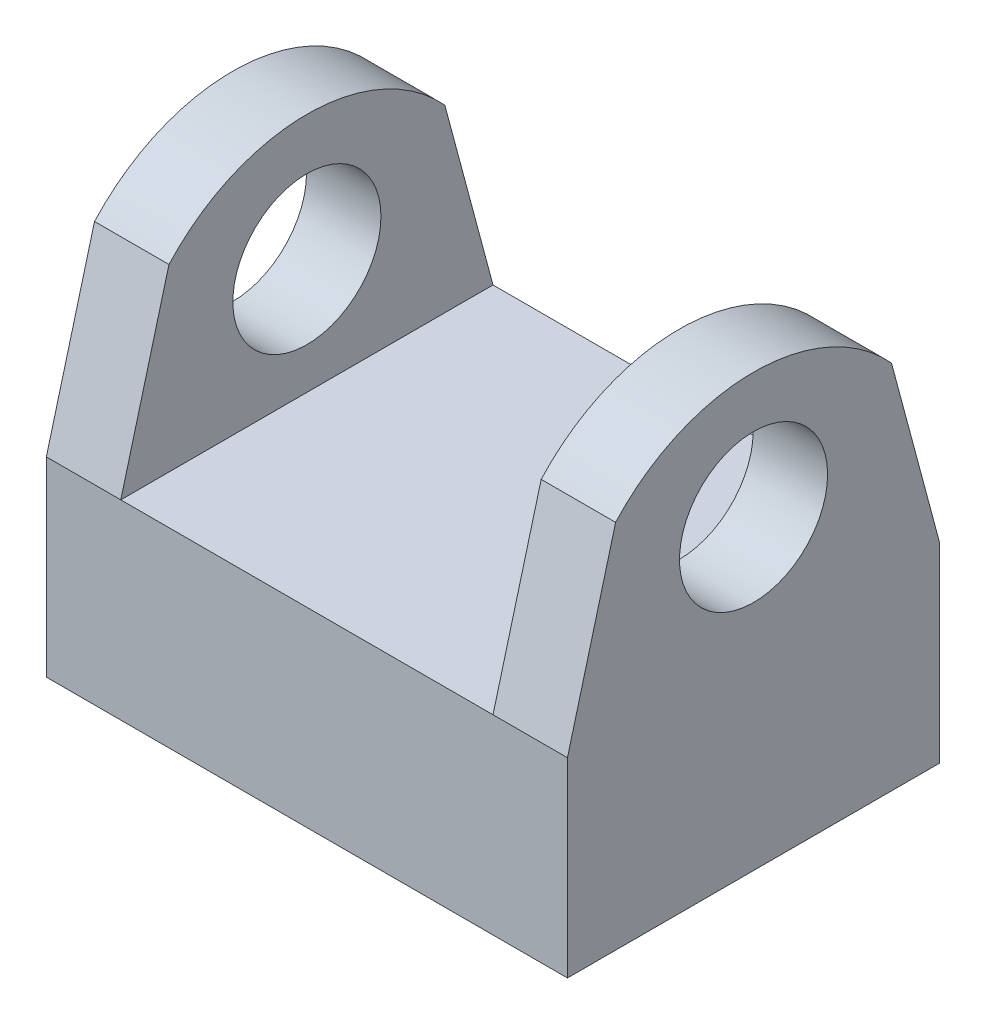
ISO-10303-21;
HEADER;
FILE_DESCRIPTION(('STEP AP214'),'2;1');
FILE_NAME('part.step','',(''),(''),'','','');
FILE_SCHEMA(('AUTOMOTIVE_DESIGN { 1 0 10303 214 1 1 1 1 }'));
ENDSEC;
DATA;
#1=APPLICATION_CONTEXT('core data for automotive mechanical design processes');
#2=APPLICATION_PROTOCOL_DEFINITION('international standard','automotive_design',2000,#1);
#3=PRODUCT_CONTEXT('',#1,'mechanical');
#4=PRODUCT('Part','Part','',(#3));
#5=PRODUCT_RELATED_PRODUCT_CATEGORY('part','',(#4));
#6=PRODUCT_DEFINITION_FORMATION('','',#4);
#7=PRODUCT_DEFINITION_CONTEXT('part definition',#1,'design');
#8=PRODUCT_DEFINITION('design','',#6,#7);
#9=PRODUCT_DEFINITION_SHAPE('','',#8);
#10=(LENGTH_UNIT() NAMED_UNIT(*) SI_UNIT(.MILLI.,.METRE.));
#11=(NAMED_UNIT(*) PLANE_ANGLE_UNIT() SI_UNIT($,.RADIAN.));
#12=(NAMED_UNIT(*) SI_UNIT($,.STERADIAN.) SOLID_ANGLE_UNIT());
#13=UNCERTAINTY_MEASURE_WITH_UNIT(LENGTH_MEASURE(1.E-05),#10,'distance_accuracy_value','');
#14=(GEOMETRIC_REPRESENTATION_CONTEXT(3) GLOBAL_UNCERTAINTY_ASSIGNED_CONTEXT((#13)) GLOBAL_UNIT_ASSIGNED_CONTEXT((#10,
#11,#12)) REPRESENTATION_CONTEXT('',''));
#15=CARTESIAN_POINT('',(0.,0.,0.));
#16=DIRECTION('',(0.,0.,1.));
#17=DIRECTION('',(1.,0.,0.));
#18=AXIS2_PLACEMENT_3D('',#15,#16,#17);
#19=CARTESIAN_POINT('',(-17.78,13.0175,12.7));
#20=DIRECTION('',(-1.,0.,0.));
#21=DIRECTION('',(0.,0.,1.));
#22=AXIS2_PLACEMENT_3D('',#19,#20,#21);
#23=PLANE('',#22);
#24=CARTESIAN_POINT('',(-17.78,20.8915,0.));
#25=DIRECTION('',(1.,0.,0.));
#26=DIRECTION('',(0.,0.,-1.));
#27=AXIS2_PLACEMENT_3D('',#24,#25,#26);
#28=CIRCLE('',#27,5.05316944316768);
#29=CARTESIAN_POINT('',(-17.78,20.8915,-5.05316944316768));
#30=VERTEX_POINT('',#29);
#31=EDGE_CURVE('E192',#30,#30,#28,.T.);
#32=ORIENTED_EDGE('',*,*,#31,.T.);
#33=EDGE_LOOP('',(#32));
#34=FACE_BOUND('',#33,.T.);
#35=DIRECTION('',(0.,0.,-1.));
#36=VECTOR('',#35,1.);
#37=CARTESIAN_POINT('',(-17.78,0.,12.7));
#38=LINE('',#37,#36);
#39=CARTESIAN_POINT('',(-17.78,0.,12.7));
#40=VERTEX_POINT('',#39);
#41=CARTESIAN_POINT('',(-17.78,0.,-12.7));
#42=VERTEX_POINT('',#41);
#43=EDGE_CURVE('E104',#40,#42,#38,.T.);
#44=ORIENTED_EDGE('',*,*,#43,.F.);
#45=DIRECTION('',(0.,-1.,0.));
#46=VECTOR('',#45,1.);
#47=CARTESIAN_POINT('',(-17.78,13.0175,12.7));
#48=LINE('',#47,#46);
#49=CARTESIAN_POINT('',(-17.78,13.0175,12.7));
#50=VERTEX_POINT('',#49);
#51=EDGE_CURVE('E11',#50,#40,#48,.T.);
#52=ORIENTED_EDGE('',*,*,#51,.F.);
#53=DIRECTION('',(0.,-0.965925826289069,0.258819045102518));
#54=VECTOR('',#53,1.);
#55=CARTESIAN_POINT('',(-17.78,13.0175,12.7));
#56=LINE('',#55,#54);
#57=CARTESIAN_POINT('',(-17.78,25.2847579938712,9.41299812719803));
#58=VERTEX_POINT('',#57);
#59=EDGE_CURVE('E174',#58,#50,#56,.T.);
#60=ORIENTED_EDGE('',*,*,#59,.F.);
#61=CARTESIAN_POINT('',(-17.78,16.7436568597658,0.));
#62=DIRECTION('',(1.,0.,0.));
#63=DIRECTION('',(0.,0.,1.));
#64=AXIS2_PLACEMENT_3D('',#61,#62,#63);
#65=CIRCLE('',#64,12.7104265202097);
#66=CARTESIAN_POINT('',(-17.78,25.2847579938712,-9.41299812719793));
#67=VERTEX_POINT('',#66);
#68=EDGE_CURVE('E171',#67,#58,#65,.T.);
#69=ORIENTED_EDGE('',*,*,#68,.F.);
#70=DIRECTION('',(0.,0.965925826289067,0.258819045102525));
#71=VECTOR('',#70,1.);
#72=CARTESIAN_POINT('',(-17.78,13.0175,-12.7));
#73=LINE('',#72,#71);
#74=CARTESIAN_POINT('',(-17.78,13.0175,-12.7));
#75=VERTEX_POINT('',#74);
#76=EDGE_CURVE('E168',#75,#67,#73,.T.);
#77=ORIENTED_EDGE('',*,*,#76,.F.);
#78=DIRECTION('',(0.,-1.,0.));
#79=VECTOR('',#78,1.);
#80=CARTESIAN_POINT('',(-17.78,13.0175,-12.7));
#81=LINE('',#80,#79);
#82=EDGE_CURVE('E108',#75,#42,#81,.T.);
#83=ORIENTED_EDGE('',*,*,#82,.T.);
#84=EDGE_LOOP('',(#44,#52,#60,#69,#77,#83));
#85=FACE_BOUND('',#84,.T.);
#86=ADVANCED_FACE('F35',(#34,#85),#23,.T.);
#87=CARTESIAN_POINT('',(-17.78,13.0175,12.7));
#88=DIRECTION('',(0.,0.,-1.));
#89=DIRECTION('',(-1.,0.,0.));
#90=AXIS2_PLACEMENT_3D('',#87,#88,#89);
#91=PLANE('',#90);
#92=DIRECTION('',(1.,0.,0.));
#93=VECTOR('',#92,1.);
#94=CARTESIAN_POINT('',(-17.78,0.,12.7));
#95=LINE('',#94,#93);
#96=CARTESIAN_POINT('',(17.78,0.,12.7));
#97=VERTEX_POINT('',#96);
#98=EDGE_CURVE('E77',#40,#97,#95,.T.);
#99=ORIENTED_EDGE('',*,*,#98,.T.);
#100=DIRECTION('',(0.,-1.,0.));
#101=VECTOR('',#100,1.);
#102=CARTESIAN_POINT('',(17.78,13.0175,12.7));
#103=LINE('',#102,#101);
#104=CARTESIAN_POINT('',(17.78,13.0175,12.7));
#105=VERTEX_POINT('',#104);
#106=EDGE_CURVE('E43',#105,#97,#103,.T.);
#107=ORIENTED_EDGE('',*,*,#106,.F.);
#108=DIRECTION('',(1.,0.,0.));
#109=VECTOR('',#108,1.);
#110=CARTESIAN_POINT('',(12.7,13.0175,12.7));
#111=LINE('',#110,#109);
#112=CARTESIAN_POINT('',(12.7,13.0175,12.7));
#113=VERTEX_POINT('',#112);
#114=EDGE_CURVE('E123',#113,#105,#111,.T.);
#115=ORIENTED_EDGE('',*,*,#114,.F.);
#116=DIRECTION('',(1.,0.,0.));
#117=VECTOR('',#116,1.);
#118=CARTESIAN_POINT('',(-17.78,13.0175,12.7));
#119=LINE('',#118,#117);
#120=CARTESIAN_POINT('',(-12.7,13.0175,12.7));
#121=VERTEX_POINT('',#120);
#122=EDGE_CURVE('E113',#121,#113,#119,.T.);
#123=ORIENTED_EDGE('',*,*,#122,.F.);
#124=EDGE_CURVE('E109',#50,#121,#119,.T.);
#125=ORIENTED_EDGE('',*,*,#124,.F.);
#126=ORIENTED_EDGE('',*,*,#51,.T.);
#127=EDGE_LOOP('',(#99,#107,#115,#123,#125,#126));
#128=FACE_BOUND('',#127,.T.);
#129=ADVANCED_FACE('F79',(#128),#91,.F.);
#130=CARTESIAN_POINT('',(17.78,13.0175,12.7));
#131=DIRECTION('',(-1.,0.,0.));
#132=DIRECTION('',(0.,0.,1.));
#133=AXIS2_PLACEMENT_3D('',#130,#131,#132);
#134=PLANE('',#133);
#135=CARTESIAN_POINT('',(17.78,20.8915,0.));
#136=DIRECTION('',(1.,0.,0.));
#137=DIRECTION('',(0.,0.,-1.));
#138=AXIS2_PLACEMENT_3D('',#135,#136,#137);
#139=CIRCLE('',#138,5.05316944316768);
#140=CARTESIAN_POINT('',(17.78,20.8915,-5.05316944316768));
#141=VERTEX_POINT('',#140);
#142=EDGE_CURVE('E189',#141,#141,#139,.T.);
#143=ORIENTED_EDGE('',*,*,#142,.F.);
#144=EDGE_LOOP('',(#143));
#145=FACE_BOUND('',#144,.T.);
#146=DIRECTION('',(0.,0.,-1.));
#147=VECTOR('',#146,1.);
#148=CARTESIAN_POINT('',(17.78,0.,12.7));
#149=LINE('',#148,#147);
#150=CARTESIAN_POINT('',(17.78,0.,-12.7));
#151=VERTEX_POINT('',#150);
#152=EDGE_CURVE('E87',#97,#151,#149,.T.);
#153=ORIENTED_EDGE('',*,*,#152,.T.);
#154=DIRECTION('',(0.,-1.,0.));
#155=VECTOR('',#154,1.);
#156=CARTESIAN_POINT('',(17.78,13.0175,-12.7));
#157=LINE('',#156,#155);
#158=CARTESIAN_POINT('',(17.78,13.0175,-12.7));
#159=VERTEX_POINT('',#158);
#160=EDGE_CURVE('E98',#159,#151,#157,.T.);
#161=ORIENTED_EDGE('',*,*,#160,.F.);
#162=DIRECTION('',(0.,0.965925826289067,0.258819045102525));
#163=VECTOR('',#162,1.);
#164=CARTESIAN_POINT('',(17.78,13.0175,-12.7));
#165=LINE('',#164,#163);
#166=CARTESIAN_POINT('',(17.78,25.2847579938712,-9.41299812719793));
#167=VERTEX_POINT('',#166);
#168=EDGE_CURVE('E149',#159,#167,#165,.T.);
#169=ORIENTED_EDGE('',*,*,#168,.T.);
#170=CARTESIAN_POINT('',(17.78,16.7436568597658,0.));
#171=DIRECTION('',(1.,0.,0.));
#172=DIRECTION('',(0.,0.,1.));
#173=AXIS2_PLACEMENT_3D('',#170,#171,#172);
#174=CIRCLE('',#173,12.7104265202097);
#175=CARTESIAN_POINT('',(17.78,25.2847579938712,9.41299812719803));
#176=VERTEX_POINT('',#175);
#177=EDGE_CURVE('E151',#167,#176,#174,.T.);
#178=ORIENTED_EDGE('',*,*,#177,.T.);
#179=DIRECTION('',(0.,-0.965925826289069,0.258819045102518));
#180=VECTOR('',#179,1.);
#181=CARTESIAN_POINT('',(17.78,13.0175,12.7));
#182=LINE('',#181,#180);
#183=EDGE_CURVE('E97',#176,#105,#182,.T.);
#184=ORIENTED_EDGE('',*,*,#183,.T.);
#185=ORIENTED_EDGE('',*,*,#106,.T.);
#186=EDGE_LOOP('',(#153,#161,#169,#178,#184,#185));
#187=FACE_BOUND('',#186,.T.);
#188=ADVANCED_FACE('F92',(#145,#187),#134,.F.);
#189=CARTESIAN_POINT('',(-17.78,13.0175,-12.7));
#190=DIRECTION('',(0.,0.,-1.));
#191=DIRECTION('',(-1.,0.,0.));
#192=AXIS2_PLACEMENT_3D('',#189,#190,#191);
#193=PLANE('',#192);
#194=DIRECTION('',(1.,0.,0.));
#195=VECTOR('',#194,1.);
#196=CARTESIAN_POINT('',(-17.78,0.,-12.7));
#197=LINE('',#196,#195);
#198=EDGE_CURVE('E102',#42,#151,#197,.T.);
#199=ORIENTED_EDGE('',*,*,#198,.F.);
#200=ORIENTED_EDGE('',*,*,#82,.F.);
#201=DIRECTION('',(1.,0.,0.));
#202=VECTOR('',#201,1.);
#203=CARTESIAN_POINT('',(-17.78,13.0175,-12.7));
#204=LINE('',#203,#202);
#205=CARTESIAN_POINT('',(-12.7,13.0175,-12.7));
#206=VERTEX_POINT('',#205);
#207=EDGE_CURVE('E59',#75,#206,#204,.T.);
#208=ORIENTED_EDGE('',*,*,#207,.T.);
#209=CARTESIAN_POINT('',(12.7,13.0175,-12.7));
#210=VERTEX_POINT('',#209);
#211=EDGE_CURVE('E51',#206,#210,#204,.T.);
#212=ORIENTED_EDGE('',*,*,#211,.T.);
#213=DIRECTION('',(1.,0.,0.));
#214=VECTOR('',#213,1.);
#215=CARTESIAN_POINT('',(12.7,13.0175,-12.7));
#216=LINE('',#215,#214);
#217=EDGE_CURVE('E136',#210,#159,#216,.T.);
#218=ORIENTED_EDGE('',*,*,#217,.T.);
#219=ORIENTED_EDGE('',*,*,#160,.T.);
#220=EDGE_LOOP('',(#199,#200,#208,#212,#218,#219));
#221=FACE_BOUND('',#220,.T.);
#222=ADVANCED_FACE('F213',(#221),#193,.T.);
#223=CARTESIAN_POINT('',(0.,13.0175,0.));
#224=DIRECTION('',(0.,-1.,0.));
#225=DIRECTION('',(0.,0.,-1.));
#226=AXIS2_PLACEMENT_3D('',#223,#224,#225);
#227=PLANE('',#226);
#228=ORIENTED_EDGE('',*,*,#211,.F.);
#229=DIRECTION('',(0.,0.,-1.));
#230=VECTOR('',#229,1.);
#231=CARTESIAN_POINT('',(-12.7,13.0175,12.7));
#232=LINE('',#231,#230);
#233=EDGE_CURVE('E170',#121,#206,#232,.T.);
#234=ORIENTED_EDGE('',*,*,#233,.F.);
#235=ORIENTED_EDGE('',*,*,#122,.T.);
#236=DIRECTION('',(0.,0.,-1.));
#237=VECTOR('',#236,1.);
#238=CARTESIAN_POINT('',(12.7,13.0175,12.7));
#239=LINE('',#238,#237);
#240=EDGE_CURVE('E155',#113,#210,#239,.T.);
#241=ORIENTED_EDGE('',*,*,#240,.T.);
#242=EDGE_LOOP('',(#228,#234,#235,#241));
#243=FACE_BOUND('',#242,.T.);
#244=ADVANCED_FACE('F212',(#243),#227,.F.);
#245=CARTESIAN_POINT('',(0.,0.,0.));
#246=DIRECTION('',(0.,-1.,0.));
#247=DIRECTION('',(0.,0.,-1.));
#248=AXIS2_PLACEMENT_3D('',#245,#246,#247);
#249=PLANE('',#248);
#250=ORIENTED_EDGE('',*,*,#43,.T.);
#251=ORIENTED_EDGE('',*,*,#198,.T.);
#252=ORIENTED_EDGE('',*,*,#152,.F.);
#253=ORIENTED_EDGE('',*,*,#98,.F.);
#254=EDGE_LOOP('',(#250,#251,#252,#253));
#255=FACE_BOUND('',#254,.T.);
#256=ADVANCED_FACE('F100',(#255),#249,.T.);
#257=CARTESIAN_POINT('',(12.7,13.0175,12.7));
#258=DIRECTION('',(0.,0.258819045102518,0.965925826289069));
#259=DIRECTION('',(0.,-0.965925826289069,0.258819045102518));
#260=AXIS2_PLACEMENT_3D('',#257,#258,#259);
#261=PLANE('',#260);
#262=ORIENTED_EDGE('',*,*,#183,.F.);
#263=DIRECTION('',(1.,0.,0.));
#264=VECTOR('',#263,1.);
#265=CARTESIAN_POINT('',(12.7,25.2847579938712,9.41299812719803));
#266=LINE('',#265,#264);
#267=CARTESIAN_POINT('',(12.7,25.2847579938712,9.41299812719803));
#268=VERTEX_POINT('',#267);
#269=EDGE_CURVE('E125',#268,#176,#266,.T.);
#270=ORIENTED_EDGE('',*,*,#269,.F.);
#271=DIRECTION('',(0.,-0.965925826289069,0.258819045102518));
#272=VECTOR('',#271,1.);
#273=CARTESIAN_POINT('',(12.7,13.0175,12.7));
#274=LINE('',#273,#272);
#275=EDGE_CURVE('E137',#268,#113,#274,.T.);
#276=ORIENTED_EDGE('',*,*,#275,.T.);
#277=ORIENTED_EDGE('',*,*,#114,.T.);
#278=EDGE_LOOP('',(#262,#270,#276,#277));
#279=FACE_BOUND('',#278,.T.);
#280=ADVANCED_FACE('F267',(#279),#261,.T.);
#281=CARTESIAN_POINT('',(12.7,16.7436568597658,0.));
#282=DIRECTION('',(1.,0.,0.));
#283=DIRECTION('',(0.,0.,-1.));
#284=AXIS2_PLACEMENT_3D('',#281,#282,#283);
#285=CYLINDRICAL_SURFACE('',#284,12.7104265202097);
#286=ORIENTED_EDGE('',*,*,#177,.F.);
#287=DIRECTION('',(1.,0.,0.));
#288=VECTOR('',#287,1.);
#289=CARTESIAN_POINT('',(12.7,25.2847579938712,-9.41299812719793));
#290=LINE('',#289,#288);
#291=CARTESIAN_POINT('',(12.7,25.2847579938712,-9.41299812719793));
#292=VERTEX_POINT('',#291);
#293=EDGE_CURVE('E130',#292,#167,#290,.T.);
#294=ORIENTED_EDGE('',*,*,#293,.F.);
#295=CARTESIAN_POINT('',(12.7,16.7436568597658,0.));
#296=DIRECTION('',(1.,0.,0.));
#297=DIRECTION('',(0.,0.,1.));
#298=AXIS2_PLACEMENT_3D('',#295,#296,#297);
#299=CIRCLE('',#298,12.7104265202097);
#300=EDGE_CURVE('E140',#292,#268,#299,.T.);
#301=ORIENTED_EDGE('',*,*,#300,.T.);
#302=ORIENTED_EDGE('',*,*,#269,.T.);
#303=EDGE_LOOP('',(#286,#294,#301,#302));
#304=FACE_BOUND('',#303,.T.);
#305=ADVANCED_FACE('F260',(#304),#285,.T.);
#306=CARTESIAN_POINT('',(12.7,13.0175,-12.7));
#307=DIRECTION('',(0.,0.258819045102525,-0.965925826289067));
#308=DIRECTION('',(0.,0.965925826289067,0.258819045102525));
#309=AXIS2_PLACEMENT_3D('',#306,#307,#308);
#310=PLANE('',#309);
#311=ORIENTED_EDGE('',*,*,#168,.F.);
#312=ORIENTED_EDGE('',*,*,#217,.F.);
#313=DIRECTION('',(0.,0.965925826289067,0.258819045102525));
#314=VECTOR('',#313,1.);
#315=CARTESIAN_POINT('',(12.7,13.0175,-12.7));
#316=LINE('',#315,#314);
#317=EDGE_CURVE('E145',#210,#292,#316,.T.);
#318=ORIENTED_EDGE('',*,*,#317,.T.);
#319=ORIENTED_EDGE('',*,*,#293,.T.);
#320=EDGE_LOOP('',(#311,#312,#318,#319));
#321=FACE_BOUND('',#320,.T.);
#322=ADVANCED_FACE('F258',(#321),#310,.T.);
#323=CARTESIAN_POINT('',(12.7,16.7436568597658,0.));
#324=DIRECTION('',(-1.,0.,0.));
#325=DIRECTION('',(0.,0.,1.));
#326=AXIS2_PLACEMENT_3D('',#323,#324,#325);
#327=PLANE('',#326);
#328=CARTESIAN_POINT('',(12.7,20.8915,0.));
#329=DIRECTION('',(-1.,0.,0.));
#330=DIRECTION('',(0.,0.,1.));
#331=AXIS2_PLACEMENT_3D('',#328,#329,#330);
#332=CIRCLE('',#331,5.05316944316768);
#333=CARTESIAN_POINT('',(12.7,20.8915,5.05316944316768));
#334=VERTEX_POINT('',#333);
#335=EDGE_CURVE('E176',#334,#334,#332,.T.);
#336=ORIENTED_EDGE('',*,*,#335,.F.);
#337=EDGE_LOOP('',(#336));
#338=FACE_BOUND('',#337,.T.);
#339=ORIENTED_EDGE('',*,*,#240,.F.);
#340=ORIENTED_EDGE('',*,*,#275,.F.);
#341=ORIENTED_EDGE('',*,*,#300,.F.);
#342=ORIENTED_EDGE('',*,*,#317,.F.);
#343=EDGE_LOOP('',(#339,#340,#341,#342));
#344=FACE_BOUND('',#343,.T.);
#345=ADVANCED_FACE('F257',(#338,#344),#327,.T.);
#346=CARTESIAN_POINT('',(-12.7,13.0175,-12.7));
#347=DIRECTION('',(0.,-0.258819045102525,0.965925826289067));
#348=DIRECTION('',(0.,-0.965925826289067,-0.258819045102525));
#349=AXIS2_PLACEMENT_3D('',#346,#347,#348);
#350=PLANE('',#349);
#351=ORIENTED_EDGE('',*,*,#76,.T.);
#352=DIRECTION('',(-1.,0.,0.));
#353=VECTOR('',#352,1.);
#354=CARTESIAN_POINT('',(-12.7,25.2847579938712,-9.41299812719793));
#355=LINE('',#354,#353);
#356=CARTESIAN_POINT('',(-12.7,25.2847579938712,-9.41299812719793));
#357=VERTEX_POINT('',#356);
#358=EDGE_CURVE('E152',#357,#67,#355,.T.);
#359=ORIENTED_EDGE('',*,*,#358,.F.);
#360=DIRECTION('',(0.,0.965925826289067,0.258819045102525));
#361=VECTOR('',#360,1.);
#362=CARTESIAN_POINT('',(-12.7,13.0175,-12.7));
#363=LINE('',#362,#361);
#364=EDGE_CURVE('E165',#206,#357,#363,.T.);
#365=ORIENTED_EDGE('',*,*,#364,.F.);
#366=ORIENTED_EDGE('',*,*,#207,.F.);
#367=EDGE_LOOP('',(#351,#359,#365,#366));
#368=FACE_BOUND('',#367,.T.);
#369=ADVANCED_FACE('F248',(#368),#350,.F.);
#370=CARTESIAN_POINT('',(-12.7,16.7436568597658,0.));
#371=DIRECTION('',(-1.,0.,0.));
#372=DIRECTION('',(0.,0.,1.));
#373=AXIS2_PLACEMENT_3D('',#370,#371,#372);
#374=CYLINDRICAL_SURFACE('',#373,12.7104265202097);
#375=ORIENTED_EDGE('',*,*,#68,.T.);
#376=DIRECTION('',(-1.,0.,0.));
#377=VECTOR('',#376,1.);
#378=CARTESIAN_POINT('',(-12.7,25.2847579938712,9.41299812719803));
#379=LINE('',#378,#377);
#380=CARTESIAN_POINT('',(-12.7,25.2847579938712,9.41299812719803));
#381=VERTEX_POINT('',#380);
#382=EDGE_CURVE('E162',#381,#58,#379,.T.);
#383=ORIENTED_EDGE('',*,*,#382,.F.);
#384=CARTESIAN_POINT('',(-12.7,16.7436568597658,0.));
#385=DIRECTION('',(1.,0.,0.));
#386=DIRECTION('',(0.,0.,1.));
#387=AXIS2_PLACEMENT_3D('',#384,#385,#386);
#388=CIRCLE('',#387,12.7104265202097);
#389=EDGE_CURVE('E179',#357,#381,#388,.T.);
#390=ORIENTED_EDGE('',*,*,#389,.F.);
#391=ORIENTED_EDGE('',*,*,#358,.T.);
#392=EDGE_LOOP('',(#375,#383,#390,#391));
#393=FACE_BOUND('',#392,.T.);
#394=ADVANCED_FACE('F240',(#393),#374,.T.);
#395=CARTESIAN_POINT('',(-12.7,13.0175,12.7));
#396=DIRECTION('',(0.,-0.258819045102518,-0.965925826289069));
#397=DIRECTION('',(0.,0.965925826289069,-0.258819045102518));
#398=AXIS2_PLACEMENT_3D('',#395,#396,#397);
#399=PLANE('',#398);
#400=ORIENTED_EDGE('',*,*,#59,.T.);
#401=ORIENTED_EDGE('',*,*,#124,.T.);
#402=DIRECTION('',(0.,-0.965925826289069,0.258819045102518));
#403=VECTOR('',#402,1.);
#404=CARTESIAN_POINT('',(-12.7,13.0175,12.7));
#405=LINE('',#404,#403);
#406=EDGE_CURVE('E182',#381,#121,#405,.T.);
#407=ORIENTED_EDGE('',*,*,#406,.F.);
#408=ORIENTED_EDGE('',*,*,#382,.T.);
#409=EDGE_LOOP('',(#400,#401,#407,#408));
#410=FACE_BOUND('',#409,.T.);
#411=ADVANCED_FACE('F205',(#410),#399,.F.);
#412=CARTESIAN_POINT('',(-12.7,16.7436568597658,0.));
#413=DIRECTION('',(1.,0.,0.));
#414=DIRECTION('',(0.,0.,1.));
#415=AXIS2_PLACEMENT_3D('',#412,#413,#414);
#416=PLANE('',#415);
#417=CARTESIAN_POINT('',(-12.7,20.8915,0.));
#418=DIRECTION('',(1.,0.,0.));
#419=DIRECTION('',(0.,0.,-1.));
#420=AXIS2_PLACEMENT_3D('',#417,#418,#419);
#421=CIRCLE('',#420,5.05316944316768);
#422=CARTESIAN_POINT('',(-12.7,20.8915,-5.05316944316768));
#423=VERTEX_POINT('',#422);
#424=EDGE_CURVE('E38',#423,#423,#421,.T.);
#425=ORIENTED_EDGE('',*,*,#424,.F.);
#426=EDGE_LOOP('',(#425));
#427=FACE_BOUND('',#426,.T.);
#428=ORIENTED_EDGE('',*,*,#233,.T.);
#429=ORIENTED_EDGE('',*,*,#364,.T.);
#430=ORIENTED_EDGE('',*,*,#389,.T.);
#431=ORIENTED_EDGE('',*,*,#406,.T.);
#432=EDGE_LOOP('',(#428,#429,#430,#431));
#433=FACE_BOUND('',#432,.T.);
#434=ADVANCED_FACE('F202',(#427,#433),#416,.T.);
#435=CARTESIAN_POINT('',(-17.78,20.8915,0.));
#436=DIRECTION('',(1.,0.,0.));
#437=DIRECTION('',(0.,0.,-1.));
#438=AXIS2_PLACEMENT_3D('',#435,#436,#437);
#439=CYLINDRICAL_SURFACE('',#438,5.05316944316768);
#440=ORIENTED_EDGE('',*,*,#424,.T.);
#441=EDGE_LOOP('',(#440));
#442=FACE_BOUND('',#441,.T.);
#443=ORIENTED_EDGE('',*,*,#31,.F.);
#444=EDGE_LOOP('',(#443));
#445=FACE_BOUND('',#444,.T.);
#446=ADVANCED_FACE('F199',(#442,#445),#439,.F.);
#447=ORIENTED_EDGE('',*,*,#335,.T.);
#448=EDGE_LOOP('',(#447));
#449=FACE_BOUND('',#448,.T.);
#450=ORIENTED_EDGE('',*,*,#142,.T.);
#451=EDGE_LOOP('',(#450));
#452=FACE_BOUND('',#451,.T.);
#453=ADVANCED_FACE('F353',(#449,#452),#439,.F.);
#454=CLOSED_SHELL('',(#86,#129,#188,#222,#244,#256,#280,#305,#322,#345,#369,#394,#411,#434,#446,#453));
#455=MANIFOLD_SOLID_BREP('B2',#454);
#456=ADVANCED_BREP_SHAPE_REPRESENTATION('',(#18,#455),#14);
#457=SHAPE_DEFINITION_REPRESENTATION(#9,#456);
ENDSEC;
END-ISO-10303-21;
